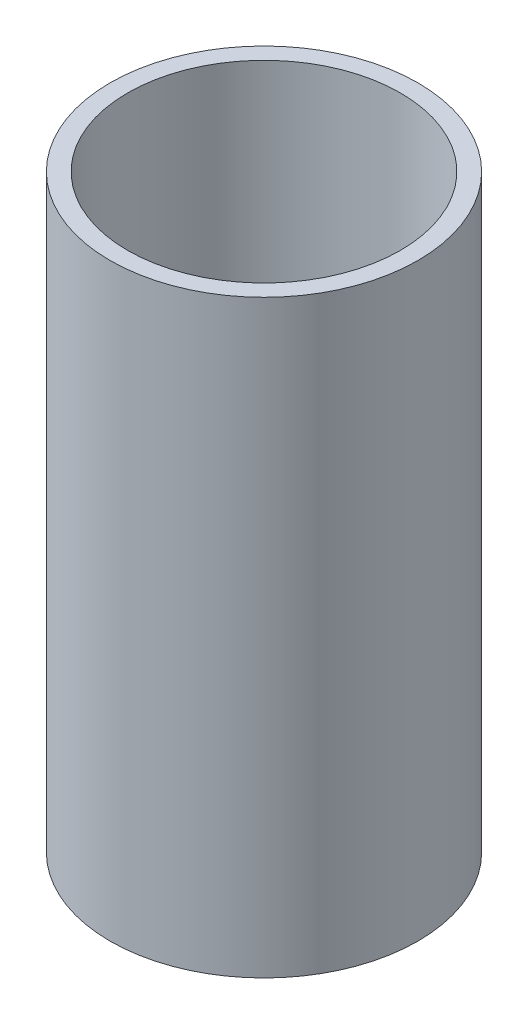
ISO-10303-21;
HEADER;
FILE_DESCRIPTION(('STEP AP214'),'2;1');
FILE_NAME('part.step','',(''),(''),'','','');
FILE_SCHEMA(('AUTOMOTIVE_DESIGN { 1 0 10303 214 1 1 1 1 }'));
ENDSEC;
DATA;
#1=APPLICATION_CONTEXT('core data for automotive mechanical design processes');
#2=APPLICATION_PROTOCOL_DEFINITION('international standard','automotive_design',2000,#1);
#3=PRODUCT_CONTEXT('',#1,'mechanical');
#4=PRODUCT('Part','Part','',(#3));
#5=PRODUCT_RELATED_PRODUCT_CATEGORY('part','',(#4));
#6=PRODUCT_DEFINITION_FORMATION('','',#4);
#7=PRODUCT_DEFINITION_CONTEXT('part definition',#1,'design');
#8=PRODUCT_DEFINITION('design','',#6,#7);
#9=PRODUCT_DEFINITION_SHAPE('','',#8);
#10=(LENGTH_UNIT() NAMED_UNIT(*) SI_UNIT(.MILLI.,.METRE.));
#11=(NAMED_UNIT(*) PLANE_ANGLE_UNIT() SI_UNIT($,.RADIAN.));
#12=(NAMED_UNIT(*) SI_UNIT($,.STERADIAN.) SOLID_ANGLE_UNIT());
#13=UNCERTAINTY_MEASURE_WITH_UNIT(LENGTH_MEASURE(1.E-05),#10,'distance_accuracy_value','');
#14=(GEOMETRIC_REPRESENTATION_CONTEXT(3) GLOBAL_UNCERTAINTY_ASSIGNED_CONTEXT((#13)) GLOBAL_UNIT_ASSIGNED_CONTEXT((#10,
#11,#12)) REPRESENTATION_CONTEXT('',''));
#15=CARTESIAN_POINT('',(0.,0.,0.));
#16=DIRECTION('',(0.,0.,1.));
#17=DIRECTION('',(1.,0.,0.));
#18=AXIS2_PLACEMENT_3D('',#15,#16,#17);
#19=CARTESIAN_POINT('',(0.,143.640134596393,0.));
#20=DIRECTION('',(0.,-1.,0.));
#21=DIRECTION('',(0.,0.,-1.));
#22=AXIS2_PLACEMENT_3D('',#19,#20,#21);
#23=CYLINDRICAL_SURFACE('',#22,37.5);
#24=CARTESIAN_POINT('',(0.,143.640134596393,0.));
#25=DIRECTION('',(0.,1.,0.));
#26=DIRECTION('',(0.,0.,1.));
#27=AXIS2_PLACEMENT_3D('',#24,#25,#26);
#28=CIRCLE('',#27,37.5);
#29=CARTESIAN_POINT('',(0.,143.640134596393,37.5));
#30=VERTEX_POINT('',#29);
#31=EDGE_CURVE('E10',#30,#30,#28,.T.);
#32=ORIENTED_EDGE('',*,*,#31,.F.);
#33=EDGE_LOOP('',(#32));
#34=FACE_BOUND('',#33,.T.);
#35=CARTESIAN_POINT('',(0.,0.,0.));
#36=DIRECTION('',(0.,1.,0.));
#37=DIRECTION('',(0.,0.,1.));
#38=AXIS2_PLACEMENT_3D('',#35,#36,#37);
#39=CIRCLE('',#38,37.5);
#40=CARTESIAN_POINT('',(0.,0.,37.5));
#41=VERTEX_POINT('',#40);
#42=EDGE_CURVE('E37',#41,#41,#39,.T.);
#43=ORIENTED_EDGE('',*,*,#42,.T.);
#44=EDGE_LOOP('',(#43));
#45=FACE_BOUND('',#44,.T.);
#46=ADVANCED_FACE('F40',(#34,#45),#23,.T.);
#47=CARTESIAN_POINT('',(0.,143.640134596393,0.));
#48=DIRECTION('',(0.,1.,0.));
#49=DIRECTION('',(0.,0.,1.));
#50=AXIS2_PLACEMENT_3D('',#47,#48,#49);
#51=PLANE('',#50);
#52=CARTESIAN_POINT('',(0.,143.640134596393,0.));
#53=DIRECTION('',(0.,1.,0.));
#54=DIRECTION('',(0.,0.,1.));
#55=AXIS2_PLACEMENT_3D('',#52,#53,#54);
#56=CIRCLE('',#55,33.2370572653947);
#57=CARTESIAN_POINT('',(0.,143.640134596393,33.2370572653947));
#58=VERTEX_POINT('',#57);
#59=EDGE_CURVE('E50',#58,#58,#56,.T.);
#60=ORIENTED_EDGE('',*,*,#59,.F.);
#61=EDGE_LOOP('',(#60));
#62=FACE_BOUND('',#61,.T.);
#63=ORIENTED_EDGE('',*,*,#31,.T.);
#64=EDGE_LOOP('',(#63));
#65=FACE_BOUND('',#64,.T.);
#66=ADVANCED_FACE('F59',(#62,#65),#51,.T.);
#67=CARTESIAN_POINT('',(0.,0.,0.));
#68=DIRECTION('',(0.,1.,0.));
#69=DIRECTION('',(0.,0.,1.));
#70=AXIS2_PLACEMENT_3D('',#67,#68,#69);
#71=PLANE('',#70);
#72=CARTESIAN_POINT('',(0.,0.,0.));
#73=DIRECTION('',(0.,1.,0.));
#74=DIRECTION('',(0.,0.,1.));
#75=AXIS2_PLACEMENT_3D('',#72,#73,#74);
#76=CIRCLE('',#75,33.2370572653947);
#77=CARTESIAN_POINT('',(0.,0.,33.2370572653947));
#78=VERTEX_POINT('',#77);
#79=EDGE_CURVE('E47',#78,#78,#76,.T.);
#80=ORIENTED_EDGE('',*,*,#79,.T.);
#81=EDGE_LOOP('',(#80));
#82=FACE_BOUND('',#81,.T.);
#83=ORIENTED_EDGE('',*,*,#42,.F.);
#84=EDGE_LOOP('',(#83));
#85=FACE_BOUND('',#84,.T.);
#86=ADVANCED_FACE('F58',(#82,#85),#71,.F.);
#87=CARTESIAN_POINT('',(0.,143.640134596393,0.));
#88=DIRECTION('',(0.,-1.,0.));
#89=DIRECTION('',(0.,0.,-1.));
#90=AXIS2_PLACEMENT_3D('',#87,#88,#89);
#91=CYLINDRICAL_SURFACE('',#90,33.2370572653947);
#92=ORIENTED_EDGE('',*,*,#59,.T.);
#93=EDGE_LOOP('',(#92));
#94=FACE_BOUND('',#93,.T.);
#95=ORIENTED_EDGE('',*,*,#79,.F.);
#96=EDGE_LOOP('',(#95));
#97=FACE_BOUND('',#96,.T.);
#98=ADVANCED_FACE('F54',(#94,#97),#91,.F.);
#99=CLOSED_SHELL('',(#46,#66,#86,#98));
#100=MANIFOLD_SOLID_BREP('B2',#99);
#101=ADVANCED_BREP_SHAPE_REPRESENTATION('',(#18,#100),#14);
#102=SHAPE_DEFINITION_REPRESENTATION(#9,#101);
ENDSEC;
END-ISO-10303-21;
